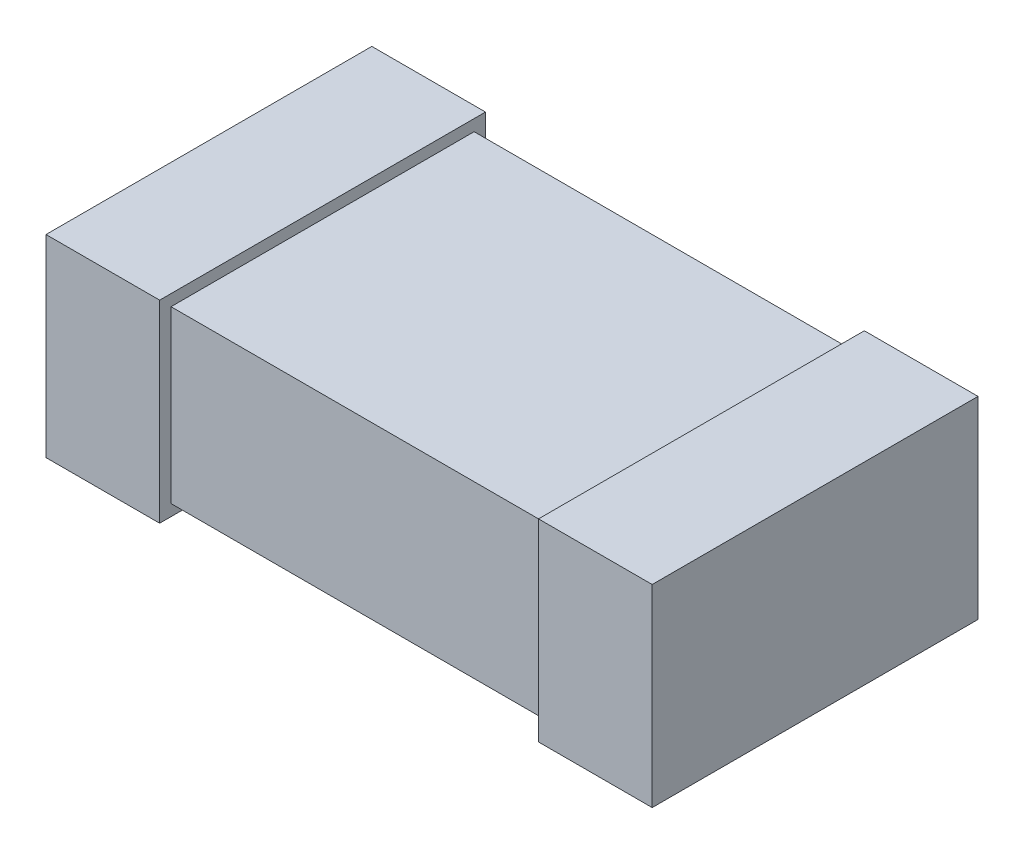
ISO-10303-21;
HEADER;
FILE_DESCRIPTION(('STEP AP214'),'2;1');
FILE_NAME('part.step','',(''),(''),'','','');
FILE_SCHEMA(('AUTOMOTIVE_DESIGN { 1 0 10303 214 1 1 1 1 }'));
ENDSEC;
DATA;
#1=APPLICATION_CONTEXT('core data for automotive mechanical design processes');
#2=APPLICATION_PROTOCOL_DEFINITION('international standard','automotive_design',2000,#1);
#3=PRODUCT_CONTEXT('',#1,'mechanical');
#4=PRODUCT('Part','Part','',(#3));
#5=PRODUCT_RELATED_PRODUCT_CATEGORY('part','',(#4));
#6=PRODUCT_DEFINITION_FORMATION('','',#4);
#7=PRODUCT_DEFINITION_CONTEXT('part definition',#1,'design');
#8=PRODUCT_DEFINITION('design','',#6,#7);
#9=PRODUCT_DEFINITION_SHAPE('','',#8);
#10=(LENGTH_UNIT() NAMED_UNIT(*) SI_UNIT(.MILLI.,.METRE.));
#11=(NAMED_UNIT(*) PLANE_ANGLE_UNIT() SI_UNIT($,.RADIAN.));
#12=(NAMED_UNIT(*) SI_UNIT($,.STERADIAN.) SOLID_ANGLE_UNIT());
#13=UNCERTAINTY_MEASURE_WITH_UNIT(LENGTH_MEASURE(1.E-05),#10,'distance_accuracy_value','');
#14=(GEOMETRIC_REPRESENTATION_CONTEXT(3) GLOBAL_UNCERTAINTY_ASSIGNED_CONTEXT((#13)) GLOBAL_UNIT_ASSIGNED_CONTEXT((#10,
#11,#12)) REPRESENTATION_CONTEXT('',''));
#15=CARTESIAN_POINT('',(0.,0.,0.));
#16=DIRECTION('',(0.,0.,1.));
#17=DIRECTION('',(1.,0.,0.));
#18=AXIS2_PLACEMENT_3D('',#15,#16,#17);
#19=CARTESIAN_POINT('',(0.5,0.,-0.4));
#20=DIRECTION('',(0.,0.,-1.));
#21=DIRECTION('',(-1.,0.,0.));
#22=AXIS2_PLACEMENT_3D('',#19,#20,#21);
#23=PLANE('',#22);
#24=DIRECTION('',(-1.,0.,0.));
#25=VECTOR('',#24,1.);
#26=CARTESIAN_POINT('',(0.5,0.45,-0.4));
#27=LINE('',#26,#25);
#28=CARTESIAN_POINT('',(0.5,0.45,-0.4));
#29=VERTEX_POINT('',#28);
#30=CARTESIAN_POINT('',(-0.5,0.45,-0.4));
#31=VERTEX_POINT('',#30);
#32=EDGE_CURVE('E100',#29,#31,#27,.T.);
#33=ORIENTED_EDGE('',*,*,#32,.F.);
#34=DIRECTION('',(0.,1.,0.));
#35=VECTOR('',#34,1.);
#36=CARTESIAN_POINT('',(0.5,0.,-0.4));
#37=LINE('',#36,#35);
#38=CARTESIAN_POINT('',(0.5,0.,-0.4));
#39=VERTEX_POINT('',#38);
#40=EDGE_CURVE('E43',#39,#29,#37,.T.);
#41=ORIENTED_EDGE('',*,*,#40,.F.);
#42=DIRECTION('',(-1.,0.,0.));
#43=VECTOR('',#42,1.);
#44=CARTESIAN_POINT('',(0.5,0.,-0.4));
#45=LINE('',#44,#43);
#46=CARTESIAN_POINT('',(-0.5,0.,-0.4));
#47=VERTEX_POINT('',#46);
#48=EDGE_CURVE('E88',#39,#47,#45,.T.);
#49=ORIENTED_EDGE('',*,*,#48,.T.);
#50=DIRECTION('',(0.,1.,0.));
#51=VECTOR('',#50,1.);
#52=CARTESIAN_POINT('',(-0.5,0.,-0.4));
#53=LINE('',#52,#51);
#54=EDGE_CURVE('E11',#47,#31,#53,.T.);
#55=ORIENTED_EDGE('',*,*,#54,.T.);
#56=EDGE_LOOP('',(#33,#41,#49,#55));
#57=FACE_BOUND('',#56,.T.);
#58=ADVANCED_FACE('F33',(#57),#23,.T.);
#59=CARTESIAN_POINT('',(-0.5,0.,0.4));
#60=DIRECTION('',(0.,0.,1.));
#61=DIRECTION('',(1.,0.,0.));
#62=AXIS2_PLACEMENT_3D('',#59,#60,#61);
#63=PLANE('',#62);
#64=DIRECTION('',(1.,0.,0.));
#65=VECTOR('',#64,1.);
#66=CARTESIAN_POINT('',(-0.5,0.45,0.4));
#67=LINE('',#66,#65);
#68=CARTESIAN_POINT('',(-0.5,0.45,0.4));
#69=VERTEX_POINT('',#68);
#70=CARTESIAN_POINT('',(0.5,0.45,0.4));
#71=VERTEX_POINT('',#70);
#72=EDGE_CURVE('E103',#69,#71,#67,.T.);
#73=ORIENTED_EDGE('',*,*,#72,.F.);
#74=DIRECTION('',(0.,1.,0.));
#75=VECTOR('',#74,1.);
#76=CARTESIAN_POINT('',(-0.5,0.,0.4));
#77=LINE('',#76,#75);
#78=CARTESIAN_POINT('',(-0.5,0.,0.4));
#79=VERTEX_POINT('',#78);
#80=EDGE_CURVE('E37',#79,#69,#77,.T.);
#81=ORIENTED_EDGE('',*,*,#80,.F.);
#82=DIRECTION('',(1.,0.,0.));
#83=VECTOR('',#82,1.);
#84=CARTESIAN_POINT('',(-0.5,0.,0.4));
#85=LINE('',#84,#83);
#86=CARTESIAN_POINT('',(0.5,0.,0.4));
#87=VERTEX_POINT('',#86);
#88=EDGE_CURVE('E87',#79,#87,#85,.T.);
#89=ORIENTED_EDGE('',*,*,#88,.T.);
#90=DIRECTION('',(0.,1.,0.));
#91=VECTOR('',#90,1.);
#92=CARTESIAN_POINT('',(0.5,0.,0.4));
#93=LINE('',#92,#91);
#94=EDGE_CURVE('E65',#87,#71,#93,.T.);
#95=ORIENTED_EDGE('',*,*,#94,.T.);
#96=EDGE_LOOP('',(#73,#81,#89,#95));
#97=FACE_BOUND('',#96,.T.);
#98=ADVANCED_FACE('F35',(#97),#63,.T.);
#99=CARTESIAN_POINT('',(0.,0.,0.));
#100=DIRECTION('',(0.,1.,0.));
#101=DIRECTION('',(0.,0.,1.));
#102=AXIS2_PLACEMENT_3D('',#99,#100,#101);
#103=PLANE('',#102);
#104=DIRECTION('',(0.,0.,1.));
#105=VECTOR('',#104,1.);
#106=CARTESIAN_POINT('',(-0.5,0.,-0.4));
#107=LINE('',#106,#105);
#108=EDGE_CURVE('E52',#47,#79,#107,.T.);
#109=ORIENTED_EDGE('',*,*,#108,.F.);
#110=ORIENTED_EDGE('',*,*,#48,.F.);
#111=DIRECTION('',(0.,0.,-1.));
#112=VECTOR('',#111,1.);
#113=CARTESIAN_POINT('',(0.5,0.,0.4));
#114=LINE('',#113,#112);
#115=EDGE_CURVE('E85',#87,#39,#114,.T.);
#116=ORIENTED_EDGE('',*,*,#115,.F.);
#117=ORIENTED_EDGE('',*,*,#88,.F.);
#118=EDGE_LOOP('',(#109,#110,#116,#117));
#119=FACE_BOUND('',#118,.T.);
#120=ADVANCED_FACE('F86',(#119),#103,.F.);
#121=CARTESIAN_POINT('',(0.,0.45,0.));
#122=DIRECTION('',(0.,1.,0.));
#123=DIRECTION('',(0.,0.,1.));
#124=AXIS2_PLACEMENT_3D('',#121,#122,#123);
#125=PLANE('',#124);
#126=DIRECTION('',(0.,0.,1.));
#127=VECTOR('',#126,1.);
#128=CARTESIAN_POINT('',(-0.5,0.45,-0.4));
#129=LINE('',#128,#127);
#130=EDGE_CURVE('E74',#31,#69,#129,.T.);
#131=ORIENTED_EDGE('',*,*,#130,.T.);
#132=ORIENTED_EDGE('',*,*,#72,.T.);
#133=DIRECTION('',(0.,0.,-1.));
#134=VECTOR('',#133,1.);
#135=CARTESIAN_POINT('',(0.5,0.45,0.4));
#136=LINE('',#135,#134);
#137=EDGE_CURVE('E97',#71,#29,#136,.T.);
#138=ORIENTED_EDGE('',*,*,#137,.T.);
#139=ORIENTED_EDGE('',*,*,#32,.T.);
#140=EDGE_LOOP('',(#131,#132,#138,#139));
#141=FACE_BOUND('',#140,.T.);
#142=ADVANCED_FACE('F271',(#141),#125,.T.);
#143=CARTESIAN_POINT('',(-0.5,0.48,0.43));
#144=DIRECTION('',(1.,0.,0.));
#145=DIRECTION('',(0.,0.,-1.));
#146=AXIS2_PLACEMENT_3D('',#143,#144,#145);
#147=PLANE('',#146);
#148=DIRECTION('',(0.,-1.,0.));
#149=VECTOR('',#148,1.);
#150=CARTESIAN_POINT('',(-0.5,0.48,-0.43));
#151=LINE('',#150,#149);
#152=CARTESIAN_POINT('',(-0.5,0.48,-0.43));
#153=VERTEX_POINT('',#152);
#154=CARTESIAN_POINT('',(-0.5,-0.03,-0.43));
#155=VERTEX_POINT('',#154);
#156=EDGE_CURVE('E125',#153,#155,#151,.T.);
#157=ORIENTED_EDGE('',*,*,#156,.F.);
#158=DIRECTION('',(0.,0.,-1.));
#159=VECTOR('',#158,1.);
#160=CARTESIAN_POINT('',(-0.5,0.48,0.43));
#161=LINE('',#160,#159);
#162=CARTESIAN_POINT('',(-0.5,0.48,0.43));
#163=VERTEX_POINT('',#162);
#164=EDGE_CURVE('E112',#163,#153,#161,.T.);
#165=ORIENTED_EDGE('',*,*,#164,.F.);
#166=DIRECTION('',(0.,-1.,0.));
#167=VECTOR('',#166,1.);
#168=CARTESIAN_POINT('',(-0.5,0.48,0.43));
#169=LINE('',#168,#167);
#170=CARTESIAN_POINT('',(-0.5,-0.03,0.43));
#171=VERTEX_POINT('',#170);
#172=EDGE_CURVE('E137',#163,#171,#169,.T.);
#173=ORIENTED_EDGE('',*,*,#172,.T.);
#174=DIRECTION('',(0.,0.,-1.));
#175=VECTOR('',#174,1.);
#176=CARTESIAN_POINT('',(-0.5,-0.03,0.43));
#177=LINE('',#176,#175);
#178=EDGE_CURVE('E116',#171,#155,#177,.T.);
#179=ORIENTED_EDGE('',*,*,#178,.T.);
#180=EDGE_LOOP('',(#157,#165,#173,#179));
#181=FACE_BOUND('',#180,.T.);
#182=ORIENTED_EDGE('',*,*,#130,.F.);
#183=ORIENTED_EDGE('',*,*,#54,.F.);
#184=ORIENTED_EDGE('',*,*,#108,.T.);
#185=ORIENTED_EDGE('',*,*,#80,.T.);
#186=EDGE_LOOP('',(#182,#183,#184,#185));
#187=FACE_BOUND('',#186,.T.);
#188=ADVANCED_FACE('F247',(#181,#187),#147,.T.);
#189=CARTESIAN_POINT('',(-0.8,-0.03,0.43));
#190=DIRECTION('',(-1.,0.,0.));
#191=DIRECTION('',(0.,-1.,0.));
#192=AXIS2_PLACEMENT_3D('',#189,#190,#191);
#193=PLANE('',#192);
#194=DIRECTION('',(0.,1.,0.));
#195=VECTOR('',#194,1.);
#196=CARTESIAN_POINT('',(-0.8,-0.03,-0.43));
#197=LINE('',#196,#195);
#198=CARTESIAN_POINT('',(-0.8,-0.03,-0.43));
#199=VERTEX_POINT('',#198);
#200=CARTESIAN_POINT('',(-0.8,0.48,-0.43));
#201=VERTEX_POINT('',#200);
#202=EDGE_CURVE('E131',#199,#201,#197,.T.);
#203=ORIENTED_EDGE('',*,*,#202,.F.);
#204=DIRECTION('',(0.,0.,-1.));
#205=VECTOR('',#204,1.);
#206=CARTESIAN_POINT('',(-0.8,-0.03,0.43));
#207=LINE('',#206,#205);
#208=CARTESIAN_POINT('',(-0.8,-0.03,0.43));
#209=VERTEX_POINT('',#208);
#210=EDGE_CURVE('E106',#209,#199,#207,.T.);
#211=ORIENTED_EDGE('',*,*,#210,.F.);
#212=DIRECTION('',(0.,1.,0.));
#213=VECTOR('',#212,1.);
#214=CARTESIAN_POINT('',(-0.8,-0.03,0.43));
#215=LINE('',#214,#213);
#216=CARTESIAN_POINT('',(-0.8,0.48,0.43));
#217=VERTEX_POINT('',#216);
#218=EDGE_CURVE('E124',#209,#217,#215,.T.);
#219=ORIENTED_EDGE('',*,*,#218,.T.);
#220=DIRECTION('',(0.,0.,-1.));
#221=VECTOR('',#220,1.);
#222=CARTESIAN_POINT('',(-0.8,0.48,0.43));
#223=LINE('',#222,#221);
#224=EDGE_CURVE('E109',#217,#201,#223,.T.);
#225=ORIENTED_EDGE('',*,*,#224,.T.);
#226=EDGE_LOOP('',(#203,#211,#219,#225));
#227=FACE_BOUND('',#226,.T.);
#228=ADVANCED_FACE('F243',(#227),#193,.T.);
#229=CARTESIAN_POINT('',(-0.5,-0.03,0.43));
#230=DIRECTION('',(0.,-1.,0.));
#231=DIRECTION('',(1.,0.,0.));
#232=AXIS2_PLACEMENT_3D('',#229,#230,#231);
#233=PLANE('',#232);
#234=DIRECTION('',(-1.,0.,0.));
#235=VECTOR('',#234,1.);
#236=CARTESIAN_POINT('',(-0.5,-0.03,-0.43));
#237=LINE('',#236,#235);
#238=EDGE_CURVE('E121',#155,#199,#237,.T.);
#239=ORIENTED_EDGE('',*,*,#238,.F.);
#240=ORIENTED_EDGE('',*,*,#178,.F.);
#241=DIRECTION('',(-1.,0.,0.));
#242=VECTOR('',#241,1.);
#243=CARTESIAN_POINT('',(-0.5,-0.03,0.43));
#244=LINE('',#243,#242);
#245=EDGE_CURVE('E113',#171,#209,#244,.T.);
#246=ORIENTED_EDGE('',*,*,#245,.T.);
#247=ORIENTED_EDGE('',*,*,#210,.T.);
#248=EDGE_LOOP('',(#239,#240,#246,#247));
#249=FACE_BOUND('',#248,.T.);
#250=ADVANCED_FACE('F239',(#249),#233,.T.);
#251=CARTESIAN_POINT('',(-0.8,0.48,0.43));
#252=DIRECTION('',(0.,1.,0.));
#253=DIRECTION('',(0.,0.,1.));
#254=AXIS2_PLACEMENT_3D('',#251,#252,#253);
#255=PLANE('',#254);
#256=DIRECTION('',(1.,0.,0.));
#257=VECTOR('',#256,1.);
#258=CARTESIAN_POINT('',(-0.8,0.48,-0.43));
#259=LINE('',#258,#257);
#260=EDGE_CURVE('E128',#201,#153,#259,.T.);
#261=ORIENTED_EDGE('',*,*,#260,.F.);
#262=ORIENTED_EDGE('',*,*,#224,.F.);
#263=DIRECTION('',(1.,0.,0.));
#264=VECTOR('',#263,1.);
#265=CARTESIAN_POINT('',(-0.8,0.48,0.43));
#266=LINE('',#265,#264);
#267=EDGE_CURVE('E140',#217,#163,#266,.T.);
#268=ORIENTED_EDGE('',*,*,#267,.T.);
#269=ORIENTED_EDGE('',*,*,#164,.T.);
#270=EDGE_LOOP('',(#261,#262,#268,#269));
#271=FACE_BOUND('',#270,.T.);
#272=ADVANCED_FACE('F254',(#271),#255,.T.);
#273=CARTESIAN_POINT('',(0.,0.,0.43));
#274=DIRECTION('',(0.,0.,-1.));
#275=DIRECTION('',(-1.,0.,0.));
#276=AXIS2_PLACEMENT_3D('',#273,#274,#275);
#277=PLANE('',#276);
#278=ORIENTED_EDGE('',*,*,#218,.F.);
#279=ORIENTED_EDGE('',*,*,#245,.F.);
#280=ORIENTED_EDGE('',*,*,#172,.F.);
#281=ORIENTED_EDGE('',*,*,#267,.F.);
#282=EDGE_LOOP('',(#278,#279,#280,#281));
#283=FACE_BOUND('',#282,.T.);
#284=ADVANCED_FACE('F253',(#283),#277,.F.);
#285=CARTESIAN_POINT('',(0.,0.,-0.43));
#286=DIRECTION('',(0.,0.,-1.));
#287=DIRECTION('',(-1.,0.,0.));
#288=AXIS2_PLACEMENT_3D('',#285,#286,#287);
#289=PLANE('',#288);
#290=ORIENTED_EDGE('',*,*,#202,.T.);
#291=ORIENTED_EDGE('',*,*,#260,.T.);
#292=ORIENTED_EDGE('',*,*,#156,.T.);
#293=ORIENTED_EDGE('',*,*,#238,.T.);
#294=EDGE_LOOP('',(#290,#291,#292,#293));
#295=FACE_BOUND('',#294,.T.);
#296=ADVANCED_FACE('F246',(#295),#289,.T.);
#297=CARTESIAN_POINT('',(0.5,0.,0.));
#298=DIRECTION('',(-1.,0.,0.));
#299=DIRECTION('',(0.,0.,1.));
#300=AXIS2_PLACEMENT_3D('',#297,#298,#299);
#301=PLANE('',#300);
#302=DIRECTION('',(0.,1.,0.));
#303=VECTOR('',#302,1.);
#304=CARTESIAN_POINT('',(0.5,-0.0299999999999998,0.43));
#305=LINE('',#304,#303);
#306=CARTESIAN_POINT('',(0.5,-0.0299999999999998,0.43));
#307=VERTEX_POINT('',#306);
#308=CARTESIAN_POINT('',(0.5,0.48,0.43));
#309=VERTEX_POINT('',#308);
#310=EDGE_CURVE('E167',#307,#309,#305,.T.);
#311=ORIENTED_EDGE('',*,*,#310,.T.);
#312=DIRECTION('',(0.,0.,-1.));
#313=VECTOR('',#312,1.);
#314=CARTESIAN_POINT('',(0.5,0.48,0.43));
#315=LINE('',#314,#313);
#316=CARTESIAN_POINT('',(0.5,0.48,-0.43));
#317=VERTEX_POINT('',#316);
#318=EDGE_CURVE('E164',#309,#317,#315,.T.);
#319=ORIENTED_EDGE('',*,*,#318,.T.);
#320=DIRECTION('',(0.,-1.,0.));
#321=VECTOR('',#320,1.);
#322=CARTESIAN_POINT('',(0.5,0.48,-0.43));
#323=LINE('',#322,#321);
#324=CARTESIAN_POINT('',(0.5,-0.0299999999999998,-0.43));
#325=VERTEX_POINT('',#324);
#326=EDGE_CURVE('E161',#317,#325,#323,.T.);
#327=ORIENTED_EDGE('',*,*,#326,.T.);
#328=DIRECTION('',(0.,0.,1.));
#329=VECTOR('',#328,1.);
#330=CARTESIAN_POINT('',(0.5,-0.0299999999999998,-0.43));
#331=LINE('',#330,#329);
#332=EDGE_CURVE('E157',#325,#307,#331,.T.);
#333=ORIENTED_EDGE('',*,*,#332,.T.);
#334=EDGE_LOOP('',(#311,#319,#327,#333));
#335=FACE_BOUND('',#334,.T.);
#336=ORIENTED_EDGE('',*,*,#137,.F.);
#337=ORIENTED_EDGE('',*,*,#94,.F.);
#338=ORIENTED_EDGE('',*,*,#115,.T.);
#339=ORIENTED_EDGE('',*,*,#40,.T.);
#340=EDGE_LOOP('',(#336,#337,#338,#339));
#341=FACE_BOUND('',#340,.T.);
#342=ADVANCED_FACE('F95',(#335,#341),#301,.T.);
#343=CARTESIAN_POINT('',(0.8,-0.0299999999999998,0.43));
#344=DIRECTION('',(0.,0.,1.));
#345=DIRECTION('',(1.,0.,0.));
#346=AXIS2_PLACEMENT_3D('',#343,#344,#345);
#347=PLANE('',#346);
#348=ORIENTED_EDGE('',*,*,#310,.F.);
#349=DIRECTION('',(-1.,0.,0.));
#350=VECTOR('',#349,1.);
#351=CARTESIAN_POINT('',(0.8,-0.0299999999999998,0.43));
#352=LINE('',#351,#350);
#353=CARTESIAN_POINT('',(0.8,-0.0299999999999998,0.43));
#354=VERTEX_POINT('',#353);
#355=EDGE_CURVE('E134',#354,#307,#352,.T.);
#356=ORIENTED_EDGE('',*,*,#355,.F.);
#357=DIRECTION('',(0.,1.,0.));
#358=VECTOR('',#357,1.);
#359=CARTESIAN_POINT('',(0.8,-0.0299999999999998,0.43));
#360=LINE('',#359,#358);
#361=CARTESIAN_POINT('',(0.8,0.48,0.43));
#362=VERTEX_POINT('',#361);
#363=EDGE_CURVE('E160',#354,#362,#360,.T.);
#364=ORIENTED_EDGE('',*,*,#363,.T.);
#365=DIRECTION('',(-1.,0.,0.));
#366=VECTOR('',#365,1.);
#367=CARTESIAN_POINT('',(0.8,0.48,0.43));
#368=LINE('',#367,#366);
#369=EDGE_CURVE('E145',#362,#309,#368,.T.);
#370=ORIENTED_EDGE('',*,*,#369,.T.);
#371=EDGE_LOOP('',(#348,#356,#364,#370));
#372=FACE_BOUND('',#371,.T.);
#373=ADVANCED_FACE('F184',(#372),#347,.T.);
#374=CARTESIAN_POINT('',(0.8,-0.0299999999999998,-0.43));
#375=DIRECTION('',(0.,-1.,0.));
#376=DIRECTION('',(0.,0.,-1.));
#377=AXIS2_PLACEMENT_3D('',#374,#375,#376);
#378=PLANE('',#377);
#379=ORIENTED_EDGE('',*,*,#332,.F.);
#380=DIRECTION('',(-1.,0.,0.));
#381=VECTOR('',#380,1.);
#382=CARTESIAN_POINT('',(0.8,-0.0299999999999998,-0.43));
#383=LINE('',#382,#381);
#384=CARTESIAN_POINT('',(0.8,-0.0299999999999998,-0.43));
#385=VERTEX_POINT('',#384);
#386=EDGE_CURVE('E152',#385,#325,#383,.T.);
#387=ORIENTED_EDGE('',*,*,#386,.F.);
#388=DIRECTION('',(0.,0.,1.));
#389=VECTOR('',#388,1.);
#390=CARTESIAN_POINT('',(0.8,-0.0299999999999998,-0.43));
#391=LINE('',#390,#389);
#392=EDGE_CURVE('E149',#385,#354,#391,.T.);
#393=ORIENTED_EDGE('',*,*,#392,.T.);
#394=ORIENTED_EDGE('',*,*,#355,.T.);
#395=EDGE_LOOP('',(#379,#387,#393,#394));
#396=FACE_BOUND('',#395,.T.);
#397=ADVANCED_FACE('F203',(#396),#378,.T.);
#398=CARTESIAN_POINT('',(0.8,0.48,-0.43));
#399=DIRECTION('',(0.,0.,-1.));
#400=DIRECTION('',(-1.,0.,0.));
#401=AXIS2_PLACEMENT_3D('',#398,#399,#400);
#402=PLANE('',#401);
#403=ORIENTED_EDGE('',*,*,#326,.F.);
#404=DIRECTION('',(-1.,0.,0.));
#405=VECTOR('',#404,1.);
#406=CARTESIAN_POINT('',(0.8,0.48,-0.43));
#407=LINE('',#406,#405);
#408=CARTESIAN_POINT('',(0.8,0.48,-0.43));
#409=VERTEX_POINT('',#408);
#410=EDGE_CURVE('E148',#409,#317,#407,.T.);
#411=ORIENTED_EDGE('',*,*,#410,.F.);
#412=DIRECTION('',(0.,-1.,0.));
#413=VECTOR('',#412,1.);
#414=CARTESIAN_POINT('',(0.8,0.48,-0.43));
#415=LINE('',#414,#413);
#416=EDGE_CURVE('E172',#409,#385,#415,.T.);
#417=ORIENTED_EDGE('',*,*,#416,.T.);
#418=ORIENTED_EDGE('',*,*,#386,.T.);
#419=EDGE_LOOP('',(#403,#411,#417,#418));
#420=FACE_BOUND('',#419,.T.);
#421=ADVANCED_FACE('F209',(#420),#402,.T.);
#422=CARTESIAN_POINT('',(0.8,0.48,0.43));
#423=DIRECTION('',(0.,1.,0.));
#424=DIRECTION('',(0.,0.,1.));
#425=AXIS2_PLACEMENT_3D('',#422,#423,#424);
#426=PLANE('',#425);
#427=ORIENTED_EDGE('',*,*,#318,.F.);
#428=ORIENTED_EDGE('',*,*,#369,.F.);
#429=DIRECTION('',(0.,0.,-1.));
#430=VECTOR('',#429,1.);
#431=CARTESIAN_POINT('',(0.8,0.48,0.43));
#432=LINE('',#431,#430);
#433=EDGE_CURVE('E175',#362,#409,#432,.T.);
#434=ORIENTED_EDGE('',*,*,#433,.T.);
#435=ORIENTED_EDGE('',*,*,#410,.T.);
#436=EDGE_LOOP('',(#427,#428,#434,#435));
#437=FACE_BOUND('',#436,.T.);
#438=ADVANCED_FACE('F212',(#437),#426,.T.);
#439=CARTESIAN_POINT('',(0.8,0.,0.));
#440=DIRECTION('',(-1.,0.,0.));
#441=DIRECTION('',(0.,0.,1.));
#442=AXIS2_PLACEMENT_3D('',#439,#440,#441);
#443=PLANE('',#442);
#444=ORIENTED_EDGE('',*,*,#363,.F.);
#445=ORIENTED_EDGE('',*,*,#392,.F.);
#446=ORIENTED_EDGE('',*,*,#416,.F.);
#447=ORIENTED_EDGE('',*,*,#433,.F.);
#448=EDGE_LOOP('',(#444,#445,#446,#447));
#449=FACE_BOUND('',#448,.T.);
#450=ADVANCED_FACE('F195',(#449),#443,.F.);
#451=CLOSED_SHELL('',(#58,#98,#120,#142,#188,#228,#250,#272,#284,#296,#342,#373,#397,#421,#438,#450));
#452=MANIFOLD_SOLID_BREP('B2',#451);
#453=ADVANCED_BREP_SHAPE_REPRESENTATION('',(#18,#452),#14);
#454=SHAPE_DEFINITION_REPRESENTATION(#9,#453);
ENDSEC;
END-ISO-10303-21;
